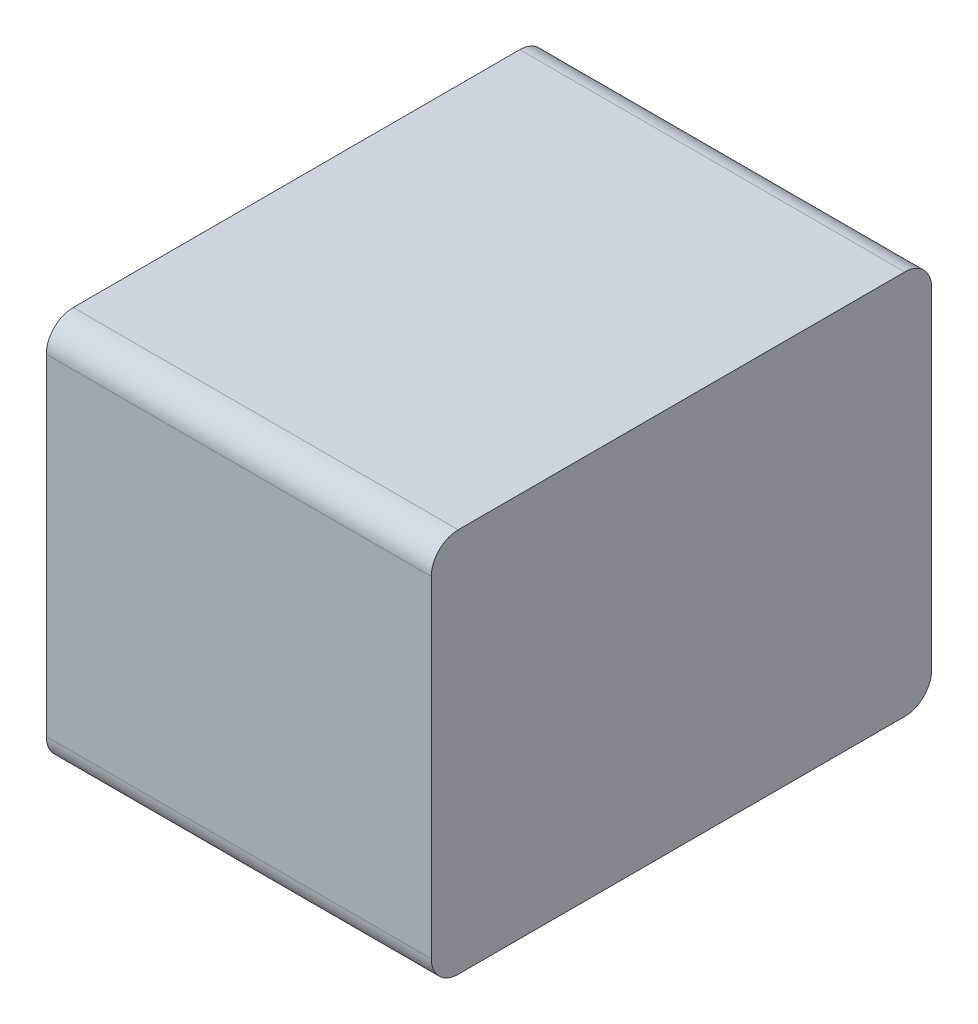
ISO-10303-21;
HEADER;
FILE_DESCRIPTION(('STEP AP214'),'2;1');
FILE_NAME('part.step','',(''),(''),'','','');
FILE_SCHEMA(('AUTOMOTIVE_DESIGN { 1 0 10303 214 1 1 1 1 }'));
ENDSEC;
DATA;
#1=APPLICATION_CONTEXT('core data for automotive mechanical design processes');
#2=APPLICATION_PROTOCOL_DEFINITION('international standard','automotive_design',2000,#1);
#3=PRODUCT_CONTEXT('',#1,'mechanical');
#4=PRODUCT('Part','Part','',(#3));
#5=PRODUCT_RELATED_PRODUCT_CATEGORY('part','',(#4));
#6=PRODUCT_DEFINITION_FORMATION('','',#4);
#7=PRODUCT_DEFINITION_CONTEXT('part definition',#1,'design');
#8=PRODUCT_DEFINITION('design','',#6,#7);
#9=PRODUCT_DEFINITION_SHAPE('','',#8);
#10=(LENGTH_UNIT() NAMED_UNIT(*) SI_UNIT(.MILLI.,.METRE.));
#11=(NAMED_UNIT(*) PLANE_ANGLE_UNIT() SI_UNIT($,.RADIAN.));
#12=(NAMED_UNIT(*) SI_UNIT($,.STERADIAN.) SOLID_ANGLE_UNIT());
#13=UNCERTAINTY_MEASURE_WITH_UNIT(LENGTH_MEASURE(1.E-05),#10,'distance_accuracy_value','');
#14=(GEOMETRIC_REPRESENTATION_CONTEXT(3) GLOBAL_UNCERTAINTY_ASSIGNED_CONTEXT((#13)) GLOBAL_UNIT_ASSIGNED_CONTEXT((#10,
#11,#12)) REPRESENTATION_CONTEXT('',''));
#15=CARTESIAN_POINT('',(0.,0.,0.));
#16=DIRECTION('',(0.,0.,1.));
#17=DIRECTION('',(1.,0.,0.));
#18=AXIS2_PLACEMENT_3D('',#15,#16,#17);
#19=CARTESIAN_POINT('',(0.25,0.,0.325));
#20=DIRECTION('',(1.,0.,0.));
#21=DIRECTION('',(0.,0.,-1.));
#22=AXIS2_PLACEMENT_3D('',#19,#20,#21);
#23=PLANE('',#22);
#24=DIRECTION('',(0.,0.,1.));
#25=VECTOR('',#24,1.);
#26=CARTESIAN_POINT('',(0.25,0.25,0.035));
#27=LINE('',#26,#25);
#28=CARTESIAN_POINT('',(0.25,0.25,0.035));
#29=VERTEX_POINT('',#28);
#30=CARTESIAN_POINT('',(0.25,0.25,0.615));
#31=VERTEX_POINT('',#30);
#32=EDGE_CURVE('E11',#29,#31,#27,.T.);
#33=ORIENTED_EDGE('',*,*,#32,.T.);
#34=CARTESIAN_POINT('',(0.25,0.215,0.615));
#35=DIRECTION('',(1.,0.,0.));
#36=DIRECTION('',(0.,1.,0.));
#37=AXIS2_PLACEMENT_3D('',#34,#35,#36);
#38=CIRCLE('',#37,0.0349999999999999);
#39=CARTESIAN_POINT('',(0.25,0.215,0.649999999999999));
#40=VERTEX_POINT('',#39);
#41=EDGE_CURVE('E24',#31,#40,#38,.T.);
#42=ORIENTED_EDGE('',*,*,#41,.T.);
#43=DIRECTION('',(0.,-1.,0.));
#44=VECTOR('',#43,1.);
#45=CARTESIAN_POINT('',(0.25,0.215,0.649999999999999));
#46=LINE('',#45,#44);
#47=CARTESIAN_POINT('',(0.25,-0.214999999999999,0.649999999999999));
#48=VERTEX_POINT('',#47);
#49=EDGE_CURVE('E141',#40,#48,#46,.T.);
#50=ORIENTED_EDGE('',*,*,#49,.T.);
#51=CARTESIAN_POINT('',(0.25,-0.214999999999999,0.614999999999999));
#52=DIRECTION('',(1.,0.,0.));
#53=DIRECTION('',(0.,0.,1.));
#54=AXIS2_PLACEMENT_3D('',#51,#52,#53);
#55=CIRCLE('',#54,0.035);
#56=CARTESIAN_POINT('',(0.25,-0.249999999999999,0.614999999999999));
#57=VERTEX_POINT('',#56);
#58=EDGE_CURVE('E139',#48,#57,#55,.T.);
#59=ORIENTED_EDGE('',*,*,#58,.T.);
#60=DIRECTION('',(0.,0.,-1.));
#61=VECTOR('',#60,1.);
#62=CARTESIAN_POINT('',(0.25,-0.249999999999999,0.614999999999999));
#63=LINE('',#62,#61);
#64=CARTESIAN_POINT('',(0.25,-0.249999999999999,0.0349999999999996));
#65=VERTEX_POINT('',#64);
#66=EDGE_CURVE('E137',#57,#65,#63,.T.);
#67=ORIENTED_EDGE('',*,*,#66,.T.);
#68=CARTESIAN_POINT('',(0.25,-0.215,0.0349999999999997));
#69=DIRECTION('',(1.,0.,0.));
#70=DIRECTION('',(0.,-1.,0.));
#71=AXIS2_PLACEMENT_3D('',#68,#69,#70);
#72=CIRCLE('',#71,0.0349999999999999);
#73=CARTESIAN_POINT('',(0.25,-0.215,0.));
#74=VERTEX_POINT('',#73);
#75=EDGE_CURVE('E135',#65,#74,#72,.T.);
#76=ORIENTED_EDGE('',*,*,#75,.T.);
#77=DIRECTION('',(0.,1.,0.));
#78=VECTOR('',#77,1.);
#79=CARTESIAN_POINT('',(0.25,-0.215,0.));
#80=LINE('',#79,#78);
#81=CARTESIAN_POINT('',(0.25,0.215,0.));
#82=VERTEX_POINT('',#81);
#83=EDGE_CURVE('E133',#74,#82,#80,.T.);
#84=ORIENTED_EDGE('',*,*,#83,.T.);
#85=CARTESIAN_POINT('',(0.25,0.215,0.035));
#86=DIRECTION('',(1.,0.,0.));
#87=DIRECTION('',(0.,0.,-1.));
#88=AXIS2_PLACEMENT_3D('',#85,#86,#87);
#89=CIRCLE('',#88,0.035);
#90=EDGE_CURVE('E131',#82,#29,#89,.T.);
#91=ORIENTED_EDGE('',*,*,#90,.T.);
#92=EDGE_LOOP('',(#33,#42,#50,#59,#67,#76,#84,#91));
#93=FACE_BOUND('',#92,.T.);
#94=ADVANCED_FACE('F17',(#93),#23,.T.);
#95=CARTESIAN_POINT('',(0.,0.215,0.615));
#96=DIRECTION('',(-1.,0.,0.));
#97=DIRECTION('',(0.,1.,0.));
#98=AXIS2_PLACEMENT_3D('',#95,#96,#97);
#99=CYLINDRICAL_SURFACE('',#98,0.0349999999999999);
#100=DIRECTION('',(1.,0.,0.));
#101=VECTOR('',#100,1.);
#102=CARTESIAN_POINT('',(0.,0.25,0.615));
#103=LINE('',#102,#101);
#104=CARTESIAN_POINT('',(-0.25,0.25,0.615));
#105=VERTEX_POINT('',#104);
#106=EDGE_CURVE('E129',#105,#31,#103,.T.);
#107=ORIENTED_EDGE('',*,*,#106,.F.);
#108=CARTESIAN_POINT('',(-0.25,0.215,0.615));
#109=DIRECTION('',(-1.,0.,0.));
#110=DIRECTION('',(0.,1.,0.));
#111=AXIS2_PLACEMENT_3D('',#108,#109,#110);
#112=CIRCLE('',#111,0.0349999999999999);
#113=CARTESIAN_POINT('',(-0.25,0.215,0.649999999999999));
#114=VERTEX_POINT('',#113);
#115=EDGE_CURVE('E96',#114,#105,#112,.T.);
#116=ORIENTED_EDGE('',*,*,#115,.F.);
#117=DIRECTION('',(1.,0.,0.));
#118=VECTOR('',#117,1.);
#119=CARTESIAN_POINT('',(0.,0.215,0.649999999999999));
#120=LINE('',#119,#118);
#121=EDGE_CURVE('E125',#114,#40,#120,.T.);
#122=ORIENTED_EDGE('',*,*,#121,.T.);
#123=ORIENTED_EDGE('',*,*,#41,.F.);
#124=EDGE_LOOP('',(#107,#116,#122,#123));
#125=FACE_BOUND('',#124,.T.);
#126=ADVANCED_FACE('F149',(#125),#99,.T.);
#127=CARTESIAN_POINT('',(0.,-0.214999999999999,0.649999999999999));
#128=DIRECTION('',(0.,0.,1.));
#129=DIRECTION('',(0.,1.,0.));
#130=AXIS2_PLACEMENT_3D('',#127,#128,#129);
#131=PLANE('',#130);
#132=ORIENTED_EDGE('',*,*,#121,.F.);
#133=DIRECTION('',(0.,1.,0.));
#134=VECTOR('',#133,1.);
#135=CARTESIAN_POINT('',(-0.25,0.215,0.649999999999999));
#136=LINE('',#135,#134);
#137=CARTESIAN_POINT('',(-0.25,-0.214999999999999,0.649999999999999));
#138=VERTEX_POINT('',#137);
#139=EDGE_CURVE('E123',#138,#114,#136,.T.);
#140=ORIENTED_EDGE('',*,*,#139,.F.);
#141=DIRECTION('',(1.,0.,0.));
#142=VECTOR('',#141,1.);
#143=CARTESIAN_POINT('',(0.,-0.214999999999999,0.649999999999999));
#144=LINE('',#143,#142);
#145=EDGE_CURVE('E120',#138,#48,#144,.T.);
#146=ORIENTED_EDGE('',*,*,#145,.T.);
#147=ORIENTED_EDGE('',*,*,#49,.F.);
#148=EDGE_LOOP('',(#132,#140,#146,#147));
#149=FACE_BOUND('',#148,.T.);
#150=ADVANCED_FACE('F147',(#149),#131,.T.);
#151=CARTESIAN_POINT('',(0.,-0.214999999999999,0.614999999999999));
#152=DIRECTION('',(-1.,0.,0.));
#153=DIRECTION('',(0.,0.,1.));
#154=AXIS2_PLACEMENT_3D('',#151,#152,#153);
#155=CYLINDRICAL_SURFACE('',#154,0.035);
#156=ORIENTED_EDGE('',*,*,#145,.F.);
#157=CARTESIAN_POINT('',(-0.25,-0.214999999999999,0.614999999999999));
#158=DIRECTION('',(-1.,0.,0.));
#159=DIRECTION('',(0.,0.,1.));
#160=AXIS2_PLACEMENT_3D('',#157,#158,#159);
#161=CIRCLE('',#160,0.035);
#162=CARTESIAN_POINT('',(-0.25,-0.249999999999999,0.614999999999999));
#163=VERTEX_POINT('',#162);
#164=EDGE_CURVE('E117',#163,#138,#161,.T.);
#165=ORIENTED_EDGE('',*,*,#164,.F.);
#166=DIRECTION('',(1.,0.,0.));
#167=VECTOR('',#166,1.);
#168=CARTESIAN_POINT('',(0.,-0.249999999999999,0.614999999999999));
#169=LINE('',#168,#167);
#170=EDGE_CURVE('E114',#163,#57,#169,.T.);
#171=ORIENTED_EDGE('',*,*,#170,.T.);
#172=ORIENTED_EDGE('',*,*,#58,.F.);
#173=EDGE_LOOP('',(#156,#165,#171,#172));
#174=FACE_BOUND('',#173,.T.);
#175=ADVANCED_FACE('F156',(#174),#155,.T.);
#176=CARTESIAN_POINT('',(0.,-0.249999999999999,0.0349999999999996));
#177=DIRECTION('',(0.,-1.,0.));
#178=DIRECTION('',(0.,0.,1.));
#179=AXIS2_PLACEMENT_3D('',#176,#177,#178);
#180=PLANE('',#179);
#181=ORIENTED_EDGE('',*,*,#170,.F.);
#182=DIRECTION('',(0.,0.,1.));
#183=VECTOR('',#182,1.);
#184=CARTESIAN_POINT('',(-0.25,-0.249999999999999,0.614999999999999));
#185=LINE('',#184,#183);
#186=CARTESIAN_POINT('',(-0.25,-0.249999999999999,0.0349999999999996));
#187=VERTEX_POINT('',#186);
#188=EDGE_CURVE('E111',#187,#163,#185,.T.);
#189=ORIENTED_EDGE('',*,*,#188,.F.);
#190=DIRECTION('',(1.,0.,0.));
#191=VECTOR('',#190,1.);
#192=CARTESIAN_POINT('',(0.,-0.249999999999999,0.0349999999999996));
#193=LINE('',#192,#191);
#194=EDGE_CURVE('E108',#187,#65,#193,.T.);
#195=ORIENTED_EDGE('',*,*,#194,.T.);
#196=ORIENTED_EDGE('',*,*,#66,.F.);
#197=EDGE_LOOP('',(#181,#189,#195,#196));
#198=FACE_BOUND('',#197,.T.);
#199=ADVANCED_FACE('F161',(#198),#180,.T.);
#200=CARTESIAN_POINT('',(0.,-0.215,0.0349999999999997));
#201=DIRECTION('',(-1.,0.,0.));
#202=DIRECTION('',(0.,-1.,0.));
#203=AXIS2_PLACEMENT_3D('',#200,#201,#202);
#204=CYLINDRICAL_SURFACE('',#203,0.0349999999999999);
#205=ORIENTED_EDGE('',*,*,#194,.F.);
#206=CARTESIAN_POINT('',(-0.25,-0.215,0.0349999999999997));
#207=DIRECTION('',(-1.,0.,0.));
#208=DIRECTION('',(0.,-1.,0.));
#209=AXIS2_PLACEMENT_3D('',#206,#207,#208);
#210=CIRCLE('',#209,0.0349999999999999);
#211=CARTESIAN_POINT('',(-0.25,-0.215,0.));
#212=VERTEX_POINT('',#211);
#213=EDGE_CURVE('E105',#212,#187,#210,.T.);
#214=ORIENTED_EDGE('',*,*,#213,.F.);
#215=DIRECTION('',(1.,0.,0.));
#216=VECTOR('',#215,1.);
#217=CARTESIAN_POINT('',(0.,-0.215,0.));
#218=LINE('',#217,#216);
#219=EDGE_CURVE('E102',#212,#74,#218,.T.);
#220=ORIENTED_EDGE('',*,*,#219,.T.);
#221=ORIENTED_EDGE('',*,*,#75,.F.);
#222=EDGE_LOOP('',(#205,#214,#220,#221));
#223=FACE_BOUND('',#222,.T.);
#224=ADVANCED_FACE('F165',(#223),#204,.T.);
#225=CARTESIAN_POINT('',(0.,0.215,0.));
#226=DIRECTION('',(0.,0.,-1.));
#227=DIRECTION('',(0.,-1.,0.));
#228=AXIS2_PLACEMENT_3D('',#225,#226,#227);
#229=PLANE('',#228);
#230=ORIENTED_EDGE('',*,*,#219,.F.);
#231=DIRECTION('',(0.,-1.,0.));
#232=VECTOR('',#231,1.);
#233=CARTESIAN_POINT('',(-0.25,-0.215,0.));
#234=LINE('',#233,#232);
#235=CARTESIAN_POINT('',(-0.25,0.215,0.));
#236=VERTEX_POINT('',#235);
#237=EDGE_CURVE('E100',#236,#212,#234,.T.);
#238=ORIENTED_EDGE('',*,*,#237,.F.);
#239=DIRECTION('',(1.,0.,0.));
#240=VECTOR('',#239,1.);
#241=CARTESIAN_POINT('',(0.,0.215,0.));
#242=LINE('',#241,#240);
#243=EDGE_CURVE('E84',#236,#82,#242,.T.);
#244=ORIENTED_EDGE('',*,*,#243,.T.);
#245=ORIENTED_EDGE('',*,*,#83,.F.);
#246=EDGE_LOOP('',(#230,#238,#244,#245));
#247=FACE_BOUND('',#246,.T.);
#248=ADVANCED_FACE('F169',(#247),#229,.T.);
#249=CARTESIAN_POINT('',(0.,0.215,0.035));
#250=DIRECTION('',(-1.,0.,0.));
#251=DIRECTION('',(0.,0.,-1.));
#252=AXIS2_PLACEMENT_3D('',#249,#250,#251);
#253=CYLINDRICAL_SURFACE('',#252,0.035);
#254=ORIENTED_EDGE('',*,*,#243,.F.);
#255=CARTESIAN_POINT('',(-0.25,0.215,0.035));
#256=DIRECTION('',(-1.,0.,0.));
#257=DIRECTION('',(0.,0.,-1.));
#258=AXIS2_PLACEMENT_3D('',#255,#256,#257);
#259=CIRCLE('',#258,0.035);
#260=CARTESIAN_POINT('',(-0.25,0.25,0.035));
#261=VERTEX_POINT('',#260);
#262=EDGE_CURVE('E79',#261,#236,#259,.T.);
#263=ORIENTED_EDGE('',*,*,#262,.F.);
#264=DIRECTION('',(-1.,0.,0.));
#265=VECTOR('',#264,1.);
#266=CARTESIAN_POINT('',(0.,0.25,0.035));
#267=LINE('',#266,#265);
#268=EDGE_CURVE('E82',#29,#261,#267,.T.);
#269=ORIENTED_EDGE('',*,*,#268,.F.);
#270=ORIENTED_EDGE('',*,*,#90,.F.);
#271=EDGE_LOOP('',(#254,#263,#269,#270));
#272=FACE_BOUND('',#271,.T.);
#273=ADVANCED_FACE('F80',(#272),#253,.T.);
#274=CARTESIAN_POINT('',(0.,0.25,0.615));
#275=DIRECTION('',(0.,1.,0.));
#276=DIRECTION('',(0.,0.,-1.));
#277=AXIS2_PLACEMENT_3D('',#274,#275,#276);
#278=PLANE('',#277);
#279=ORIENTED_EDGE('',*,*,#268,.T.);
#280=DIRECTION('',(0.,0.,-1.));
#281=VECTOR('',#280,1.);
#282=CARTESIAN_POINT('',(-0.25,0.25,0.035));
#283=LINE('',#282,#281);
#284=EDGE_CURVE('E91',#105,#261,#283,.T.);
#285=ORIENTED_EDGE('',*,*,#284,.F.);
#286=ORIENTED_EDGE('',*,*,#106,.T.);
#287=ORIENTED_EDGE('',*,*,#32,.F.);
#288=EDGE_LOOP('',(#279,#285,#286,#287));
#289=FACE_BOUND('',#288,.T.);
#290=ADVANCED_FACE('F90',(#289),#278,.T.);
#291=CARTESIAN_POINT('',(-0.25,0.,0.325));
#292=DIRECTION('',(1.,0.,0.));
#293=DIRECTION('',(0.,0.,-1.));
#294=AXIS2_PLACEMENT_3D('',#291,#292,#293);
#295=PLANE('',#294);
#296=ORIENTED_EDGE('',*,*,#284,.T.);
#297=ORIENTED_EDGE('',*,*,#262,.T.);
#298=ORIENTED_EDGE('',*,*,#237,.T.);
#299=ORIENTED_EDGE('',*,*,#213,.T.);
#300=ORIENTED_EDGE('',*,*,#188,.T.);
#301=ORIENTED_EDGE('',*,*,#164,.T.);
#302=ORIENTED_EDGE('',*,*,#139,.T.);
#303=ORIENTED_EDGE('',*,*,#115,.T.);
#304=EDGE_LOOP('',(#296,#297,#298,#299,#300,#301,#302,#303));
#305=FACE_BOUND('',#304,.T.);
#306=ADVANCED_FACE('F94',(#305),#295,.F.);
#307=CLOSED_SHELL('',(#94,#126,#150,#175,#199,#224,#248,#273,#290,#306));
#308=MANIFOLD_SOLID_BREP('B1',#307);
#309=ADVANCED_BREP_SHAPE_REPRESENTATION('',(#18,#308),#14);
#310=SHAPE_DEFINITION_REPRESENTATION(#9,#309);
ENDSEC;
END-ISO-10303-21;
